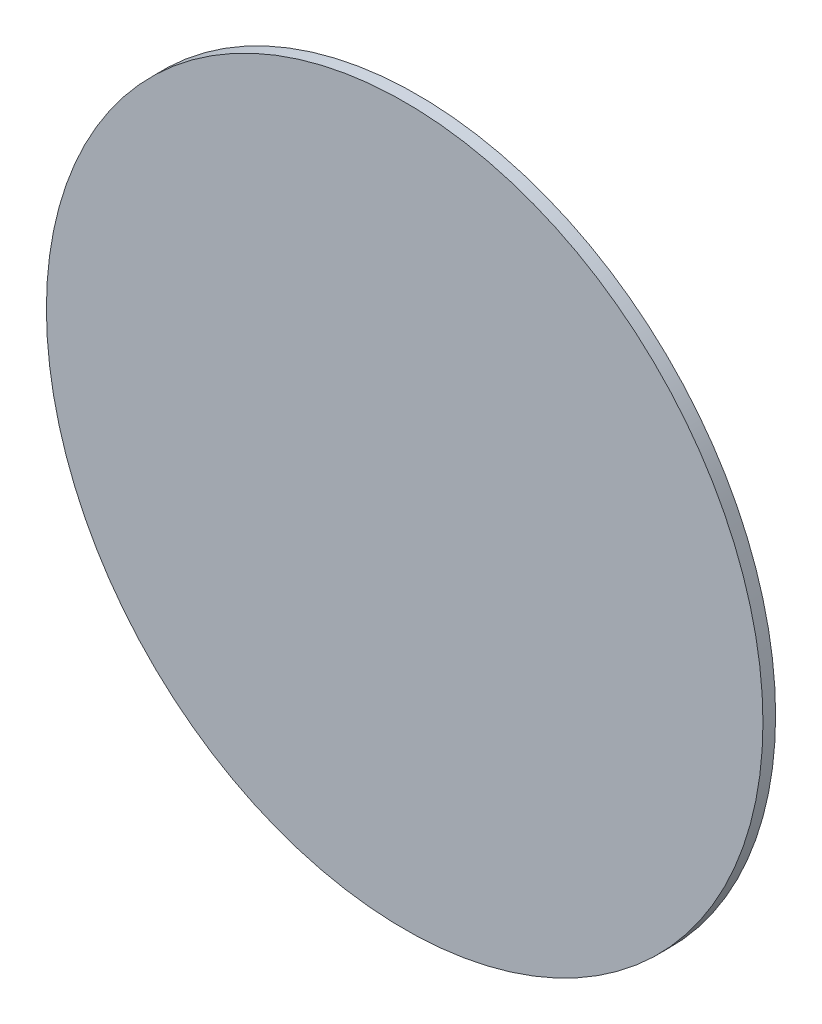
ISO-10303-21;
HEADER;
FILE_DESCRIPTION(('STEP AP214'),'2;1');
FILE_NAME('part.step','',(''),(''),'','','');
FILE_SCHEMA(('AUTOMOTIVE_DESIGN { 1 0 10303 214 1 1 1 1 }'));
ENDSEC;
DATA;
#1=APPLICATION_CONTEXT('core data for automotive mechanical design processes');
#2=APPLICATION_PROTOCOL_DEFINITION('international standard','automotive_design',2000,#1);
#3=PRODUCT_CONTEXT('',#1,'mechanical');
#4=PRODUCT('Part','Part','',(#3));
#5=PRODUCT_RELATED_PRODUCT_CATEGORY('part','',(#4));
#6=PRODUCT_DEFINITION_FORMATION('','',#4);
#7=PRODUCT_DEFINITION_CONTEXT('part definition',#1,'design');
#8=PRODUCT_DEFINITION('design','',#6,#7);
#9=PRODUCT_DEFINITION_SHAPE('','',#8);
#10=(LENGTH_UNIT() NAMED_UNIT(*) SI_UNIT(.MILLI.,.METRE.));
#11=(NAMED_UNIT(*) PLANE_ANGLE_UNIT() SI_UNIT($,.RADIAN.));
#12=(NAMED_UNIT(*) SI_UNIT($,.STERADIAN.) SOLID_ANGLE_UNIT());
#13=UNCERTAINTY_MEASURE_WITH_UNIT(LENGTH_MEASURE(1.E-05),#10,'distance_accuracy_value','');
#14=(GEOMETRIC_REPRESENTATION_CONTEXT(3) GLOBAL_UNCERTAINTY_ASSIGNED_CONTEXT((#13)) GLOBAL_UNIT_ASSIGNED_CONTEXT((#10,
#11,#12)) REPRESENTATION_CONTEXT('',''));
#15=CARTESIAN_POINT('',(0.,0.,0.));
#16=DIRECTION('',(0.,0.,1.));
#17=DIRECTION('',(1.,0.,0.));
#18=AXIS2_PLACEMENT_3D('',#15,#16,#17);
#19=CARTESIAN_POINT('',(0.,0.,3.));
#20=DIRECTION('',(0.,0.,-1.));
#21=DIRECTION('',(-1.,0.,0.));
#22=AXIS2_PLACEMENT_3D('',#19,#20,#21);
#23=CYLINDRICAL_SURFACE('',#22,85.);
#24=CARTESIAN_POINT('',(0.,0.,3.));
#25=DIRECTION('',(0.,0.,1.));
#26=DIRECTION('',(1.,0.,0.));
#27=AXIS2_PLACEMENT_3D('',#24,#25,#26);
#28=CIRCLE('',#27,85.);
#29=CARTESIAN_POINT('',(85.,0.,3.));
#30=VERTEX_POINT('',#29);
#31=EDGE_CURVE('E10',#30,#30,#28,.T.);
#32=ORIENTED_EDGE('',*,*,#31,.F.);
#33=EDGE_LOOP('',(#32));
#34=FACE_BOUND('',#33,.T.);
#35=CARTESIAN_POINT('',(0.,0.,0.));
#36=DIRECTION('',(0.,0.,1.));
#37=DIRECTION('',(1.,0.,0.));
#38=AXIS2_PLACEMENT_3D('',#35,#36,#37);
#39=CIRCLE('',#38,85.);
#40=CARTESIAN_POINT('',(85.,0.,0.));
#41=VERTEX_POINT('',#40);
#42=EDGE_CURVE('E33',#41,#41,#39,.T.);
#43=ORIENTED_EDGE('',*,*,#42,.T.);
#44=EDGE_LOOP('',(#43));
#45=FACE_BOUND('',#44,.T.);
#46=ADVANCED_FACE('F30',(#34,#45),#23,.T.);
#47=CARTESIAN_POINT('',(0.,0.,3.));
#48=DIRECTION('',(0.,0.,1.));
#49=DIRECTION('',(1.,0.,0.));
#50=AXIS2_PLACEMENT_3D('',#47,#48,#49);
#51=PLANE('',#50);
#52=ORIENTED_EDGE('',*,*,#31,.T.);
#53=EDGE_LOOP('',(#52));
#54=FACE_BOUND('',#53,.T.);
#55=ADVANCED_FACE('F45',(#54),#51,.T.);
#56=CARTESIAN_POINT('',(0.,0.,0.));
#57=DIRECTION('',(0.,0.,1.));
#58=DIRECTION('',(1.,0.,0.));
#59=AXIS2_PLACEMENT_3D('',#56,#57,#58);
#60=PLANE('',#59);
#61=ORIENTED_EDGE('',*,*,#42,.F.);
#62=EDGE_LOOP('',(#61));
#63=FACE_BOUND('',#62,.T.);
#64=ADVANCED_FACE('F43',(#63),#60,.F.);
#65=CLOSED_SHELL('',(#46,#55,#64));
#66=MANIFOLD_SOLID_BREP('B2',#65);
#67=ADVANCED_BREP_SHAPE_REPRESENTATION('',(#18,#66),#14);
#68=SHAPE_DEFINITION_REPRESENTATION(#9,#67);
ENDSEC;
END-ISO-10303-21;
